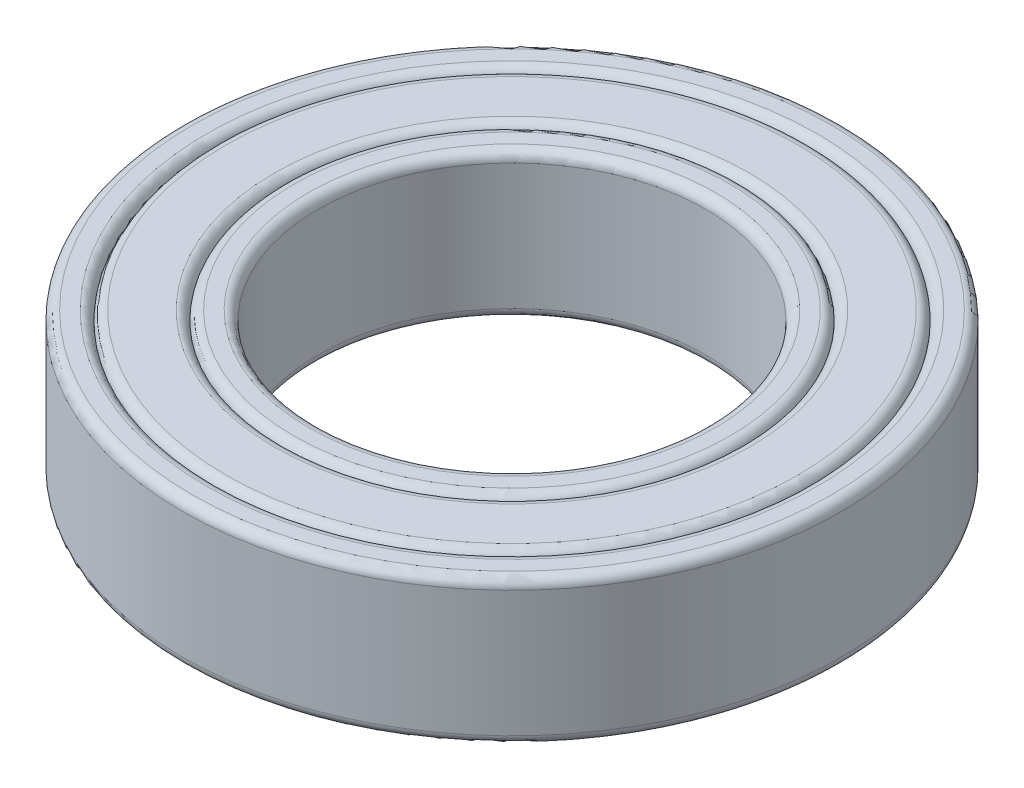
ISO-10303-21;
HEADER;
FILE_DESCRIPTION(('STEP AP214'),'2;1');
FILE_NAME('part.step','',(''),(''),'','','');
FILE_SCHEMA(('AUTOMOTIVE_DESIGN { 1 0 10303 214 1 1 1 1 }'));
ENDSEC;
DATA;
#1=APPLICATION_CONTEXT('core data for automotive mechanical design processes');
#2=APPLICATION_PROTOCOL_DEFINITION('international standard','automotive_design',2000,#1);
#3=PRODUCT_CONTEXT('',#1,'mechanical');
#4=PRODUCT('Part','Part','',(#3));
#5=PRODUCT_RELATED_PRODUCT_CATEGORY('part','',(#4));
#6=PRODUCT_DEFINITION_FORMATION('','',#4);
#7=PRODUCT_DEFINITION_CONTEXT('part definition',#1,'design');
#8=PRODUCT_DEFINITION('design','',#6,#7);
#9=PRODUCT_DEFINITION_SHAPE('','',#8);
#10=(LENGTH_UNIT() NAMED_UNIT(*) SI_UNIT(.MILLI.,.METRE.));
#11=(NAMED_UNIT(*) PLANE_ANGLE_UNIT() SI_UNIT($,.RADIAN.));
#12=(NAMED_UNIT(*) SI_UNIT($,.STERADIAN.) SOLID_ANGLE_UNIT());
#13=UNCERTAINTY_MEASURE_WITH_UNIT(LENGTH_MEASURE(1.E-05),#10,'distance_accuracy_value','');
#14=(GEOMETRIC_REPRESENTATION_CONTEXT(3) GLOBAL_UNCERTAINTY_ASSIGNED_CONTEXT((#13)) GLOBAL_UNIT_ASSIGNED_CONTEXT((#10,
#11,#12)) REPRESENTATION_CONTEXT('',''));
#15=CARTESIAN_POINT('',(0.,0.,0.));
#16=DIRECTION('',(0.,0.,1.));
#17=DIRECTION('',(1.,0.,0.));
#18=AXIS2_PLACEMENT_3D('',#15,#16,#17);
#19=CARTESIAN_POINT('',(0.,7.5,0.));
#20=DIRECTION('',(0.,-1.,0.));
#21=DIRECTION('',(0.,0.,-1.));
#22=AXIS2_PLACEMENT_3D('',#19,#20,#21);
#23=CYLINDRICAL_SURFACE('',#22,34.);
#24=CARTESIAN_POINT('',(0.,-6.5,0.));
#25=DIRECTION('',(0.,1.,0.));
#26=DIRECTION('',(0.,0.,1.));
#27=AXIS2_PLACEMENT_3D('',#24,#25,#26);
#28=CIRCLE('',#27,34.);
#29=CARTESIAN_POINT('',(0.,-6.5,34.));
#30=VERTEX_POINT('',#29);
#31=EDGE_CURVE('E95',#30,#30,#28,.T.);
#32=ORIENTED_EDGE('',*,*,#31,.T.);
#33=EDGE_LOOP('',(#32));
#34=FACE_BOUND('',#33,.T.);
#35=CARTESIAN_POINT('',(0.,6.5,0.));
#36=DIRECTION('',(0.,1.,0.));
#37=DIRECTION('',(0.,0.,1.));
#38=AXIS2_PLACEMENT_3D('',#35,#36,#37);
#39=CIRCLE('',#38,34.);
#40=CARTESIAN_POINT('',(0.,6.5,34.));
#41=VERTEX_POINT('',#40);
#42=EDGE_CURVE('E98',#41,#41,#39,.F.);
#43=ORIENTED_EDGE('',*,*,#42,.T.);
#44=EDGE_LOOP('',(#43));
#45=FACE_BOUND('',#44,.T.);
#46=ADVANCED_FACE('F33',(#34,#45),#23,.T.);
#47=CARTESIAN_POINT('',(0.,7.5,0.));
#48=DIRECTION('',(0.,1.,0.));
#49=DIRECTION('',(0.,0.,1.));
#50=AXIS2_PLACEMENT_3D('',#47,#48,#49);
#51=PLANE('',#50);
#52=CARTESIAN_POINT('',(0.,7.5,0.));
#53=DIRECTION('',(0.,1.,0.));
#54=DIRECTION('',(0.,0.,1.));
#55=AXIS2_PLACEMENT_3D('',#52,#53,#54);
#56=CIRCLE('',#55,31.5);
#57=CARTESIAN_POINT('',(0.,7.5,31.5));
#58=VERTEX_POINT('',#57);
#59=EDGE_CURVE('E80',#58,#58,#56,.F.);
#60=ORIENTED_EDGE('',*,*,#59,.T.);
#61=EDGE_LOOP('',(#60));
#62=FACE_BOUND('',#61,.T.);
#63=CARTESIAN_POINT('',(0.,7.5,0.));
#64=DIRECTION('',(0.,1.,0.));
#65=DIRECTION('',(0.,0.,1.));
#66=AXIS2_PLACEMENT_3D('',#63,#64,#65);
#67=CIRCLE('',#66,33.);
#68=CARTESIAN_POINT('',(0.,7.5,33.));
#69=VERTEX_POINT('',#68);
#70=EDGE_CURVE('E89',#69,#69,#67,.T.);
#71=ORIENTED_EDGE('',*,*,#70,.T.);
#72=EDGE_LOOP('',(#71));
#73=FACE_BOUND('',#72,.T.);
#74=ADVANCED_FACE('F111',(#62,#73),#51,.T.);
#75=CARTESIAN_POINT('',(0.,-7.5,0.));
#76=DIRECTION('',(0.,1.,0.));
#77=DIRECTION('',(0.,0.,1.));
#78=AXIS2_PLACEMENT_3D('',#75,#76,#77);
#79=PLANE('',#78);
#80=CARTESIAN_POINT('',(0.,-7.5,0.));
#81=DIRECTION('',(0.,1.,0.));
#82=DIRECTION('',(0.,0.,1.));
#83=AXIS2_PLACEMENT_3D('',#80,#81,#82);
#84=CIRCLE('',#83,31.5);
#85=CARTESIAN_POINT('',(0.,-7.5,31.5));
#86=VERTEX_POINT('',#85);
#87=EDGE_CURVE('E77',#86,#86,#84,.T.);
#88=ORIENTED_EDGE('',*,*,#87,.T.);
#89=EDGE_LOOP('',(#88));
#90=FACE_BOUND('',#89,.T.);
#91=CARTESIAN_POINT('',(0.,-7.5,0.));
#92=DIRECTION('',(0.,1.,0.));
#93=DIRECTION('',(0.,0.,1.));
#94=AXIS2_PLACEMENT_3D('',#91,#92,#93);
#95=CIRCLE('',#94,33.);
#96=CARTESIAN_POINT('',(0.,-7.5,33.));
#97=VERTEX_POINT('',#96);
#98=EDGE_CURVE('E92',#97,#97,#95,.F.);
#99=ORIENTED_EDGE('',*,*,#98,.T.);
#100=EDGE_LOOP('',(#99));
#101=FACE_BOUND('',#100,.T.);
#102=ADVANCED_FACE('F113',(#90,#101),#79,.F.);
#103=CARTESIAN_POINT('',(0.,-6.5,0.));
#104=DIRECTION('',(0.,1.,0.));
#105=DIRECTION('',(0.,0.,1.));
#106=AXIS2_PLACEMENT_3D('',#103,#104,#105);
#107=TOROIDAL_SURFACE('',#106,33.,1.);
#108=ORIENTED_EDGE('',*,*,#98,.F.);
#109=EDGE_LOOP('',(#108));
#110=FACE_BOUND('',#109,.T.);
#111=ORIENTED_EDGE('',*,*,#31,.F.);
#112=EDGE_LOOP('',(#111));
#113=FACE_BOUND('',#112,.T.);
#114=ADVANCED_FACE('F107',(#110,#113),#107,.T.);
#115=CARTESIAN_POINT('',(0.,6.5,0.));
#116=DIRECTION('',(0.,1.,0.));
#117=DIRECTION('',(0.,0.,1.));
#118=AXIS2_PLACEMENT_3D('',#115,#116,#117);
#119=TOROIDAL_SURFACE('',#118,33.,1.);
#120=ORIENTED_EDGE('',*,*,#42,.F.);
#121=EDGE_LOOP('',(#120));
#122=FACE_BOUND('',#121,.T.);
#123=ORIENTED_EDGE('',*,*,#70,.F.);
#124=EDGE_LOOP('',(#123));
#125=FACE_BOUND('',#124,.T.);
#126=ADVANCED_FACE('F103',(#122,#125),#119,.T.);
#127=CARTESIAN_POINT('',(0.,6.5,0.));
#128=DIRECTION('',(0.,1.,0.));
#129=DIRECTION('',(0.,0.,1.));
#130=AXIS2_PLACEMENT_3D('',#127,#128,#129);
#131=TOROIDAL_SURFACE('',#130,31.5,1.);
#132=ORIENTED_EDGE('',*,*,#59,.F.);
#133=EDGE_LOOP('',(#132));
#134=FACE_BOUND('',#133,.T.);
#135=CARTESIAN_POINT('',(0.,6.5,0.));
#136=DIRECTION('',(0.,1.,0.));
#137=DIRECTION('',(0.,0.,1.));
#138=AXIS2_PLACEMENT_3D('',#135,#136,#137);
#139=CIRCLE('',#138,30.5);
#140=CARTESIAN_POINT('',(0.,6.5,30.5));
#141=VERTEX_POINT('',#140);
#142=EDGE_CURVE('E83',#141,#141,#139,.T.);
#143=ORIENTED_EDGE('',*,*,#142,.F.);
#144=EDGE_LOOP('',(#143));
#145=FACE_BOUND('',#144,.T.);
#146=ADVANCED_FACE('F106',(#134,#145),#131,.T.);
#147=CARTESIAN_POINT('',(0.,-6.5,0.));
#148=DIRECTION('',(0.,1.,0.));
#149=DIRECTION('',(0.,0.,1.));
#150=AXIS2_PLACEMENT_3D('',#147,#148,#149);
#151=TOROIDAL_SURFACE('',#150,31.5,1.);
#152=CARTESIAN_POINT('',(0.,-6.5,0.));
#153=DIRECTION('',(0.,1.,0.));
#154=DIRECTION('',(0.,0.,1.));
#155=AXIS2_PLACEMENT_3D('',#152,#153,#154);
#156=CIRCLE('',#155,30.5);
#157=CARTESIAN_POINT('',(0.,-6.5,30.5));
#158=VERTEX_POINT('',#157);
#159=EDGE_CURVE('E86',#158,#158,#156,.F.);
#160=ORIENTED_EDGE('',*,*,#159,.F.);
#161=EDGE_LOOP('',(#160));
#162=FACE_BOUND('',#161,.T.);
#163=ORIENTED_EDGE('',*,*,#87,.F.);
#164=EDGE_LOOP('',(#163));
#165=FACE_BOUND('',#164,.T.);
#166=ADVANCED_FACE('F133',(#162,#165),#151,.T.);
#167=CARTESIAN_POINT('',(0.,-7.5,0.));
#168=DIRECTION('',(0.,1.,0.));
#169=DIRECTION('',(0.,0.,1.));
#170=AXIS2_PLACEMENT_3D('',#167,#168,#169);
#171=PLANE('',#170);
#172=CARTESIAN_POINT('',(0.,-7.5,0.));
#173=DIRECTION('',(0.,1.,0.));
#174=DIRECTION('',(0.,0.,1.));
#175=AXIS2_PLACEMENT_3D('',#172,#173,#174);
#176=CIRCLE('',#175,24.5);
#177=CARTESIAN_POINT('',(0.,-7.5,24.5));
#178=VERTEX_POINT('',#177);
#179=EDGE_CURVE('E59',#178,#178,#176,.T.);
#180=ORIENTED_EDGE('',*,*,#179,.T.);
#181=EDGE_LOOP('',(#180));
#182=FACE_BOUND('',#181,.T.);
#183=CARTESIAN_POINT('',(0.,-7.5,0.));
#184=DIRECTION('',(0.,1.,0.));
#185=DIRECTION('',(0.,0.,1.));
#186=AXIS2_PLACEMENT_3D('',#183,#184,#185);
#187=CIRCLE('',#186,29.5);
#188=CARTESIAN_POINT('',(0.,-7.5,29.5));
#189=VERTEX_POINT('',#188);
#190=EDGE_CURVE('E74',#189,#189,#187,.F.);
#191=ORIENTED_EDGE('',*,*,#190,.T.);
#192=EDGE_LOOP('',(#191));
#193=FACE_BOUND('',#192,.T.);
#194=ADVANCED_FACE('F137',(#182,#193),#171,.F.);
#195=CARTESIAN_POINT('',(0.,7.5,0.));
#196=DIRECTION('',(0.,1.,0.));
#197=DIRECTION('',(0.,0.,1.));
#198=AXIS2_PLACEMENT_3D('',#195,#196,#197);
#199=PLANE('',#198);
#200=CARTESIAN_POINT('',(0.,7.5,0.));
#201=DIRECTION('',(0.,1.,0.));
#202=DIRECTION('',(0.,0.,1.));
#203=AXIS2_PLACEMENT_3D('',#200,#201,#202);
#204=CIRCLE('',#203,24.5);
#205=CARTESIAN_POINT('',(0.,7.5,24.5));
#206=VERTEX_POINT('',#205);
#207=EDGE_CURVE('E62',#206,#206,#204,.F.);
#208=ORIENTED_EDGE('',*,*,#207,.T.);
#209=EDGE_LOOP('',(#208));
#210=FACE_BOUND('',#209,.T.);
#211=CARTESIAN_POINT('',(0.,7.5,0.));
#212=DIRECTION('',(0.,1.,0.));
#213=DIRECTION('',(0.,0.,1.));
#214=AXIS2_PLACEMENT_3D('',#211,#212,#213);
#215=CIRCLE('',#214,29.5);
#216=CARTESIAN_POINT('',(0.,7.5,29.5));
#217=VERTEX_POINT('',#216);
#218=EDGE_CURVE('E71',#217,#217,#215,.T.);
#219=ORIENTED_EDGE('',*,*,#218,.T.);
#220=EDGE_LOOP('',(#219));
#221=FACE_BOUND('',#220,.T.);
#222=ADVANCED_FACE('F125',(#210,#221),#199,.T.);
#223=CARTESIAN_POINT('',(0.,-6.5,0.));
#224=DIRECTION('',(0.,1.,0.));
#225=DIRECTION('',(0.,0.,1.));
#226=AXIS2_PLACEMENT_3D('',#223,#224,#225);
#227=TOROIDAL_SURFACE('',#226,29.5,1.);
#228=ORIENTED_EDGE('',*,*,#190,.F.);
#229=EDGE_LOOP('',(#228));
#230=FACE_BOUND('',#229,.T.);
#231=ORIENTED_EDGE('',*,*,#159,.T.);
#232=EDGE_LOOP('',(#231));
#233=FACE_BOUND('',#232,.T.);
#234=ADVANCED_FACE('F139',(#230,#233),#227,.T.);
#235=CARTESIAN_POINT('',(0.,6.5,0.));
#236=DIRECTION('',(0.,1.,0.));
#237=DIRECTION('',(0.,0.,1.));
#238=AXIS2_PLACEMENT_3D('',#235,#236,#237);
#239=TOROIDAL_SURFACE('',#238,29.5,1.);
#240=ORIENTED_EDGE('',*,*,#142,.T.);
#241=EDGE_LOOP('',(#240));
#242=FACE_BOUND('',#241,.T.);
#243=ORIENTED_EDGE('',*,*,#218,.F.);
#244=EDGE_LOOP('',(#243));
#245=FACE_BOUND('',#244,.T.);
#246=ADVANCED_FACE('F142',(#242,#245),#239,.T.);
#247=CARTESIAN_POINT('',(0.,6.5,0.));
#248=DIRECTION('',(0.,1.,0.));
#249=DIRECTION('',(0.,0.,1.));
#250=AXIS2_PLACEMENT_3D('',#247,#248,#249);
#251=TOROIDAL_SURFACE('',#250,24.5,1.);
#252=ORIENTED_EDGE('',*,*,#207,.F.);
#253=EDGE_LOOP('',(#252));
#254=FACE_BOUND('',#253,.T.);
#255=CARTESIAN_POINT('',(0.,6.5,0.));
#256=DIRECTION('',(0.,1.,0.));
#257=DIRECTION('',(0.,0.,1.));
#258=AXIS2_PLACEMENT_3D('',#255,#256,#257);
#259=CIRCLE('',#258,23.5);
#260=CARTESIAN_POINT('',(0.,6.5,23.5));
#261=VERTEX_POINT('',#260);
#262=EDGE_CURVE('E65',#261,#261,#259,.T.);
#263=ORIENTED_EDGE('',*,*,#262,.F.);
#264=EDGE_LOOP('',(#263));
#265=FACE_BOUND('',#264,.T.);
#266=ADVANCED_FACE('F146',(#254,#265),#251,.T.);
#267=CARTESIAN_POINT('',(0.,-6.5,0.));
#268=DIRECTION('',(0.,1.,0.));
#269=DIRECTION('',(0.,0.,1.));
#270=AXIS2_PLACEMENT_3D('',#267,#268,#269);
#271=TOROIDAL_SURFACE('',#270,24.5,1.);
#272=CARTESIAN_POINT('',(0.,-6.5,0.));
#273=DIRECTION('',(0.,1.,0.));
#274=DIRECTION('',(0.,0.,1.));
#275=AXIS2_PLACEMENT_3D('',#272,#273,#274);
#276=CIRCLE('',#275,23.5);
#277=CARTESIAN_POINT('',(0.,-6.5,23.5));
#278=VERTEX_POINT('',#277);
#279=EDGE_CURVE('E68',#278,#278,#276,.F.);
#280=ORIENTED_EDGE('',*,*,#279,.F.);
#281=EDGE_LOOP('',(#280));
#282=FACE_BOUND('',#281,.T.);
#283=ORIENTED_EDGE('',*,*,#179,.F.);
#284=EDGE_LOOP('',(#283));
#285=FACE_BOUND('',#284,.T.);
#286=ADVANCED_FACE('F150',(#282,#285),#271,.T.);
#287=CARTESIAN_POINT('',(0.,-7.5,0.));
#288=DIRECTION('',(0.,1.,0.));
#289=DIRECTION('',(0.,0.,1.));
#290=AXIS2_PLACEMENT_3D('',#287,#288,#289);
#291=PLANE('',#290);
#292=CARTESIAN_POINT('',(0.,-7.5,0.));
#293=DIRECTION('',(0.,1.,0.));
#294=DIRECTION('',(0.,0.,1.));
#295=AXIS2_PLACEMENT_3D('',#292,#293,#294);
#296=CIRCLE('',#295,21.);
#297=CARTESIAN_POINT('',(0.,-7.5,21.));
#298=VERTEX_POINT('',#297);
#299=EDGE_CURVE('E10',#298,#298,#296,.T.);
#300=ORIENTED_EDGE('',*,*,#299,.T.);
#301=EDGE_LOOP('',(#300));
#302=FACE_BOUND('',#301,.T.);
#303=CARTESIAN_POINT('',(0.,-7.5,0.));
#304=DIRECTION('',(0.,1.,0.));
#305=DIRECTION('',(0.,0.,1.));
#306=AXIS2_PLACEMENT_3D('',#303,#304,#305);
#307=CIRCLE('',#306,22.5);
#308=CARTESIAN_POINT('',(0.,-7.5,22.5));
#309=VERTEX_POINT('',#308);
#310=EDGE_CURVE('E56',#309,#309,#307,.F.);
#311=ORIENTED_EDGE('',*,*,#310,.T.);
#312=EDGE_LOOP('',(#311));
#313=FACE_BOUND('',#312,.T.);
#314=ADVANCED_FACE('F154',(#302,#313),#291,.F.);
#315=CARTESIAN_POINT('',(0.,7.5,0.));
#316=DIRECTION('',(0.,1.,0.));
#317=DIRECTION('',(0.,0.,1.));
#318=AXIS2_PLACEMENT_3D('',#315,#316,#317);
#319=PLANE('',#318);
#320=CARTESIAN_POINT('',(0.,7.5,0.));
#321=DIRECTION('',(0.,1.,0.));
#322=DIRECTION('',(0.,0.,1.));
#323=AXIS2_PLACEMENT_3D('',#320,#321,#322);
#324=CIRCLE('',#323,21.);
#325=CARTESIAN_POINT('',(0.,7.5,21.));
#326=VERTEX_POINT('',#325);
#327=EDGE_CURVE('E40',#326,#326,#324,.F.);
#328=ORIENTED_EDGE('',*,*,#327,.T.);
#329=EDGE_LOOP('',(#328));
#330=FACE_BOUND('',#329,.T.);
#331=CARTESIAN_POINT('',(0.,7.5,0.));
#332=DIRECTION('',(0.,1.,0.));
#333=DIRECTION('',(0.,0.,1.));
#334=AXIS2_PLACEMENT_3D('',#331,#332,#333);
#335=CIRCLE('',#334,22.5);
#336=CARTESIAN_POINT('',(0.,7.5,22.5));
#337=VERTEX_POINT('',#336);
#338=EDGE_CURVE('E53',#337,#337,#335,.T.);
#339=ORIENTED_EDGE('',*,*,#338,.T.);
#340=EDGE_LOOP('',(#339));
#341=FACE_BOUND('',#340,.T.);
#342=ADVANCED_FACE('F160',(#330,#341),#319,.T.);
#343=CARTESIAN_POINT('',(0.,-6.5,0.));
#344=DIRECTION('',(0.,1.,0.));
#345=DIRECTION('',(0.,0.,1.));
#346=AXIS2_PLACEMENT_3D('',#343,#344,#345);
#347=TOROIDAL_SURFACE('',#346,22.5,1.);
#348=ORIENTED_EDGE('',*,*,#310,.F.);
#349=EDGE_LOOP('',(#348));
#350=FACE_BOUND('',#349,.T.);
#351=ORIENTED_EDGE('',*,*,#279,.T.);
#352=EDGE_LOOP('',(#351));
#353=FACE_BOUND('',#352,.T.);
#354=ADVANCED_FACE('F156',(#350,#353),#347,.T.);
#355=CARTESIAN_POINT('',(0.,6.5,0.));
#356=DIRECTION('',(0.,1.,0.));
#357=DIRECTION('',(0.,0.,1.));
#358=AXIS2_PLACEMENT_3D('',#355,#356,#357);
#359=TOROIDAL_SURFACE('',#358,22.5,1.);
#360=ORIENTED_EDGE('',*,*,#262,.T.);
#361=EDGE_LOOP('',(#360));
#362=FACE_BOUND('',#361,.T.);
#363=ORIENTED_EDGE('',*,*,#338,.F.);
#364=EDGE_LOOP('',(#363));
#365=FACE_BOUND('',#364,.T.);
#366=ADVANCED_FACE('F159',(#362,#365),#359,.T.);
#367=CARTESIAN_POINT('',(0.,-7.5,0.));
#368=DIRECTION('',(0.,1.,0.));
#369=DIRECTION('',(0.,0.,1.));
#370=AXIS2_PLACEMENT_3D('',#367,#368,#369);
#371=CYLINDRICAL_SURFACE('',#370,20.);
#372=CARTESIAN_POINT('',(0.,6.5,0.));
#373=DIRECTION('',(0.,1.,0.));
#374=DIRECTION('',(0.,0.,1.));
#375=AXIS2_PLACEMENT_3D('',#372,#373,#374);
#376=CIRCLE('',#375,20.);
#377=CARTESIAN_POINT('',(0.,6.5,20.));
#378=VERTEX_POINT('',#377);
#379=EDGE_CURVE('E44',#378,#378,#376,.T.);
#380=ORIENTED_EDGE('',*,*,#379,.T.);
#381=EDGE_LOOP('',(#380));
#382=FACE_BOUND('',#381,.T.);
#383=CARTESIAN_POINT('',(0.,-6.5,0.));
#384=DIRECTION('',(0.,1.,0.));
#385=DIRECTION('',(0.,0.,1.));
#386=AXIS2_PLACEMENT_3D('',#383,#384,#385);
#387=CIRCLE('',#386,20.);
#388=CARTESIAN_POINT('',(0.,-6.5,20.));
#389=VERTEX_POINT('',#388);
#390=EDGE_CURVE('E48',#389,#389,#387,.F.);
#391=ORIENTED_EDGE('',*,*,#390,.T.);
#392=EDGE_LOOP('',(#391));
#393=FACE_BOUND('',#392,.T.);
#394=ADVANCED_FACE('F163',(#382,#393),#371,.F.);
#395=CARTESIAN_POINT('',(0.,6.5,0.));
#396=DIRECTION('',(0.,1.,0.));
#397=DIRECTION('',(0.,0.,1.));
#398=AXIS2_PLACEMENT_3D('',#395,#396,#397);
#399=TOROIDAL_SURFACE('',#398,21.,1.);
#400=ORIENTED_EDGE('',*,*,#327,.F.);
#401=EDGE_LOOP('',(#400));
#402=FACE_BOUND('',#401,.T.);
#403=ORIENTED_EDGE('',*,*,#379,.F.);
#404=EDGE_LOOP('',(#403));
#405=FACE_BOUND('',#404,.T.);
#406=ADVANCED_FACE('F165',(#402,#405),#399,.T.);
#407=CARTESIAN_POINT('',(0.,-6.5,0.));
#408=DIRECTION('',(0.,1.,0.));
#409=DIRECTION('',(0.,0.,1.));
#410=AXIS2_PLACEMENT_3D('',#407,#408,#409);
#411=TOROIDAL_SURFACE('',#410,21.,1.);
#412=ORIENTED_EDGE('',*,*,#390,.F.);
#413=EDGE_LOOP('',(#412));
#414=FACE_BOUND('',#413,.T.);
#415=ORIENTED_EDGE('',*,*,#299,.F.);
#416=EDGE_LOOP('',(#415));
#417=FACE_BOUND('',#416,.T.);
#418=ADVANCED_FACE('F35',(#414,#417),#411,.T.);
#419=CLOSED_SHELL('',(#46,#74,#102,#114,#126,#146,#166,#194,#222,#234,#246,#266,#286,#314,#342,
#354,#366,#394,#406,#418));
#420=MANIFOLD_SOLID_BREP('B2',#419);
#421=ADVANCED_BREP_SHAPE_REPRESENTATION('',(#18,#420),#14);
#422=SHAPE_DEFINITION_REPRESENTATION(#9,#421);
ENDSEC;
END-ISO-10303-21;
